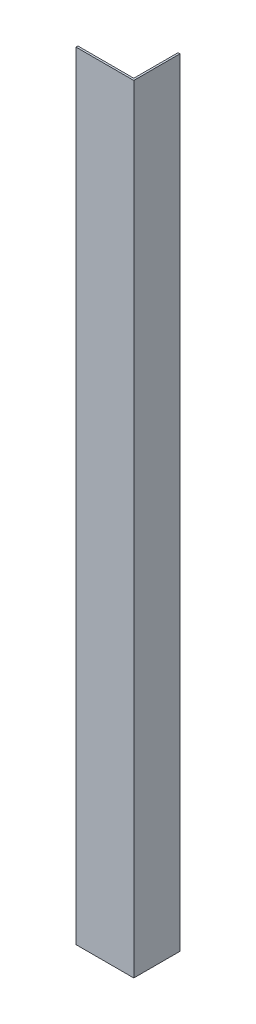
ISO-10303-21;
HEADER;
FILE_DESCRIPTION(('STEP AP214'),'2;1');
FILE_NAME('part.step','',(''),(''),'','','');
FILE_SCHEMA(('AUTOMOTIVE_DESIGN { 1 0 10303 214 1 1 1 1 }'));
ENDSEC;
DATA;
#1=APPLICATION_CONTEXT('core data for automotive mechanical design processes');
#2=APPLICATION_PROTOCOL_DEFINITION('international standard','automotive_design',2000,#1);
#3=PRODUCT_CONTEXT('',#1,'mechanical');
#4=PRODUCT('Part','Part','',(#3));
#5=PRODUCT_RELATED_PRODUCT_CATEGORY('part','',(#4));
#6=PRODUCT_DEFINITION_FORMATION('','',#4);
#7=PRODUCT_DEFINITION_CONTEXT('part definition',#1,'design');
#8=PRODUCT_DEFINITION('design','',#6,#7);
#9=PRODUCT_DEFINITION_SHAPE('','',#8);
#10=(LENGTH_UNIT() NAMED_UNIT(*) SI_UNIT(.MILLI.,.METRE.));
#11=(NAMED_UNIT(*) PLANE_ANGLE_UNIT() SI_UNIT($,.RADIAN.));
#12=(NAMED_UNIT(*) SI_UNIT($,.STERADIAN.) SOLID_ANGLE_UNIT());
#13=UNCERTAINTY_MEASURE_WITH_UNIT(LENGTH_MEASURE(1.E-05),#10,'distance_accuracy_value','');
#14=(GEOMETRIC_REPRESENTATION_CONTEXT(3) GLOBAL_UNCERTAINTY_ASSIGNED_CONTEXT((#13)) GLOBAL_UNIT_ASSIGNED_CONTEXT((#10,
#11,#12)) REPRESENTATION_CONTEXT('',''));
#15=CARTESIAN_POINT('',(0.,0.,0.));
#16=DIRECTION('',(0.,0.,1.));
#17=DIRECTION('',(1.,0.,0.));
#18=AXIS2_PLACEMENT_3D('',#15,#16,#17);
#19=CARTESIAN_POINT('',(0.,202.,-0.5));
#20=DIRECTION('',(1.,0.,0.));
#21=DIRECTION('',(0.,0.,-1.));
#22=AXIS2_PLACEMENT_3D('',#19,#20,#21);
#23=PLANE('',#22);
#24=DIRECTION('',(0.,0.,1.));
#25=VECTOR('',#24,1.);
#26=CARTESIAN_POINT('',(0.,0.,-0.5));
#27=LINE('',#26,#25);
#28=CARTESIAN_POINT('',(0.,0.,-0.5));
#29=VERTEX_POINT('',#28);
#30=CARTESIAN_POINT('',(0.,0.,0.));
#31=VERTEX_POINT('',#30);
#32=EDGE_CURVE('E123',#29,#31,#27,.T.);
#33=ORIENTED_EDGE('',*,*,#32,.T.);
#34=DIRECTION('',(0.,-1.,0.));
#35=VECTOR('',#34,1.);
#36=CARTESIAN_POINT('',(0.,202.,0.));
#37=LINE('',#36,#35);
#38=CARTESIAN_POINT('',(0.,202.,0.));
#39=VERTEX_POINT('',#38);
#40=EDGE_CURVE('E11',#39,#31,#37,.T.);
#41=ORIENTED_EDGE('',*,*,#40,.F.);
#42=DIRECTION('',(0.,0.,1.));
#43=VECTOR('',#42,1.);
#44=CARTESIAN_POINT('',(0.,202.,-0.5));
#45=LINE('',#44,#43);
#46=CARTESIAN_POINT('',(0.,202.,-0.5));
#47=VERTEX_POINT('',#46);
#48=EDGE_CURVE('E133',#47,#39,#45,.T.);
#49=ORIENTED_EDGE('',*,*,#48,.F.);
#50=DIRECTION('',(0.,-1.,0.));
#51=VECTOR('',#50,1.);
#52=CARTESIAN_POINT('',(0.,202.,-0.5));
#53=LINE('',#52,#51);
#54=EDGE_CURVE('E119',#47,#29,#53,.T.);
#55=ORIENTED_EDGE('',*,*,#54,.T.);
#56=EDGE_LOOP('',(#33,#41,#49,#55));
#57=FACE_BOUND('',#56,.T.);
#58=ADVANCED_FACE('F39',(#57),#23,.F.);
#59=CARTESIAN_POINT('',(0.,202.,0.));
#60=DIRECTION('',(0.,0.,-1.));
#61=DIRECTION('',(-1.,0.,0.));
#62=AXIS2_PLACEMENT_3D('',#59,#60,#61);
#63=PLANE('',#62);
#64=DIRECTION('',(1.,0.,0.));
#65=VECTOR('',#64,1.);
#66=CARTESIAN_POINT('',(0.,0.,0.));
#67=LINE('',#66,#65);
#68=CARTESIAN_POINT('',(15.,0.,0.));
#69=VERTEX_POINT('',#68);
#70=EDGE_CURVE('E126',#31,#69,#67,.T.);
#71=ORIENTED_EDGE('',*,*,#70,.T.);
#72=DIRECTION('',(0.,-1.,0.));
#73=VECTOR('',#72,1.);
#74=CARTESIAN_POINT('',(15.,202.,0.));
#75=LINE('',#74,#73);
#76=CARTESIAN_POINT('',(15.,202.,0.));
#77=VERTEX_POINT('',#76);
#78=EDGE_CURVE('E47',#77,#69,#75,.T.);
#79=ORIENTED_EDGE('',*,*,#78,.F.);
#80=DIRECTION('',(1.,0.,0.));
#81=VECTOR('',#80,1.);
#82=CARTESIAN_POINT('',(0.,202.,0.));
#83=LINE('',#82,#81);
#84=EDGE_CURVE('E92',#39,#77,#83,.T.);
#85=ORIENTED_EDGE('',*,*,#84,.F.);
#86=ORIENTED_EDGE('',*,*,#40,.T.);
#87=EDGE_LOOP('',(#71,#79,#85,#86));
#88=FACE_BOUND('',#87,.T.);
#89=ADVANCED_FACE('F157',(#88),#63,.F.);
#90=CARTESIAN_POINT('',(15.,202.,0.));
#91=DIRECTION('',(-1.,0.,0.));
#92=DIRECTION('',(0.,0.,1.));
#93=AXIS2_PLACEMENT_3D('',#90,#91,#92);
#94=PLANE('',#93);
#95=DIRECTION('',(0.,0.,-1.));
#96=VECTOR('',#95,1.);
#97=CARTESIAN_POINT('',(15.,0.,0.));
#98=LINE('',#97,#96);
#99=CARTESIAN_POINT('',(15.,0.,-12.));
#100=VERTEX_POINT('',#99);
#101=EDGE_CURVE('E128',#69,#100,#98,.T.);
#102=ORIENTED_EDGE('',*,*,#101,.T.);
#103=DIRECTION('',(0.,-1.,0.));
#104=VECTOR('',#103,1.);
#105=CARTESIAN_POINT('',(15.,202.,-12.));
#106=LINE('',#105,#104);
#107=CARTESIAN_POINT('',(15.,202.,-12.));
#108=VERTEX_POINT('',#107);
#109=EDGE_CURVE('E114',#108,#100,#106,.T.);
#110=ORIENTED_EDGE('',*,*,#109,.F.);
#111=DIRECTION('',(0.,0.,-1.));
#112=VECTOR('',#111,1.);
#113=CARTESIAN_POINT('',(15.,202.,0.));
#114=LINE('',#113,#112);
#115=EDGE_CURVE('E105',#77,#108,#114,.T.);
#116=ORIENTED_EDGE('',*,*,#115,.F.);
#117=ORIENTED_EDGE('',*,*,#78,.T.);
#118=EDGE_LOOP('',(#102,#110,#116,#117));
#119=FACE_BOUND('',#118,.T.);
#120=ADVANCED_FACE('F139',(#119),#94,.F.);
#121=CARTESIAN_POINT('',(15.,202.,-12.));
#122=DIRECTION('',(0.,0.,1.));
#123=DIRECTION('',(1.,0.,0.));
#124=AXIS2_PLACEMENT_3D('',#121,#122,#123);
#125=PLANE('',#124);
#126=DIRECTION('',(-1.,0.,0.));
#127=VECTOR('',#126,1.);
#128=CARTESIAN_POINT('',(15.,0.,-12.));
#129=LINE('',#128,#127);
#130=CARTESIAN_POINT('',(14.5,0.,-12.));
#131=VERTEX_POINT('',#130);
#132=EDGE_CURVE('E113',#100,#131,#129,.T.);
#133=ORIENTED_EDGE('',*,*,#132,.T.);
#134=DIRECTION('',(0.,-1.,0.));
#135=VECTOR('',#134,1.);
#136=CARTESIAN_POINT('',(14.5,202.,-12.));
#137=LINE('',#136,#135);
#138=CARTESIAN_POINT('',(14.5,202.,-12.));
#139=VERTEX_POINT('',#138);
#140=EDGE_CURVE('E110',#139,#131,#137,.T.);
#141=ORIENTED_EDGE('',*,*,#140,.F.);
#142=DIRECTION('',(-1.,0.,0.));
#143=VECTOR('',#142,1.);
#144=CARTESIAN_POINT('',(15.,202.,-12.));
#145=LINE('',#144,#143);
#146=EDGE_CURVE('E99',#108,#139,#145,.T.);
#147=ORIENTED_EDGE('',*,*,#146,.F.);
#148=ORIENTED_EDGE('',*,*,#109,.T.);
#149=EDGE_LOOP('',(#133,#141,#147,#148));
#150=FACE_BOUND('',#149,.T.);
#151=ADVANCED_FACE('F111',(#150),#125,.F.);
#152=CARTESIAN_POINT('',(14.5,202.,-12.));
#153=DIRECTION('',(1.,0.,0.));
#154=DIRECTION('',(0.,0.,-1.));
#155=AXIS2_PLACEMENT_3D('',#152,#153,#154);
#156=PLANE('',#155);
#157=DIRECTION('',(0.,0.,1.));
#158=VECTOR('',#157,1.);
#159=CARTESIAN_POINT('',(14.5,0.,-12.));
#160=LINE('',#159,#158);
#161=CARTESIAN_POINT('',(14.5,0.,-0.500000000000002));
#162=VERTEX_POINT('',#161);
#163=EDGE_CURVE('E78',#131,#162,#160,.T.);
#164=ORIENTED_EDGE('',*,*,#163,.T.);
#165=DIRECTION('',(0.,-1.,0.));
#166=VECTOR('',#165,1.);
#167=CARTESIAN_POINT('',(14.5,202.,-0.500000000000002));
#168=LINE('',#167,#166);
#169=CARTESIAN_POINT('',(14.5,202.,-0.500000000000002));
#170=VERTEX_POINT('',#169);
#171=EDGE_CURVE('E115',#170,#162,#168,.T.);
#172=ORIENTED_EDGE('',*,*,#171,.F.);
#173=DIRECTION('',(0.,0.,1.));
#174=VECTOR('',#173,1.);
#175=CARTESIAN_POINT('',(14.5,202.,-12.));
#176=LINE('',#175,#174);
#177=EDGE_CURVE('E103',#139,#170,#176,.T.);
#178=ORIENTED_EDGE('',*,*,#177,.F.);
#179=ORIENTED_EDGE('',*,*,#140,.T.);
#180=EDGE_LOOP('',(#164,#172,#178,#179));
#181=FACE_BOUND('',#180,.T.);
#182=ADVANCED_FACE('F117',(#181),#156,.F.);
#183=CARTESIAN_POINT('',(14.5,202.,-0.500000000000002));
#184=DIRECTION('',(0.,0.,1.));
#185=DIRECTION('',(1.,0.,0.));
#186=AXIS2_PLACEMENT_3D('',#183,#184,#185);
#187=PLANE('',#186);
#188=DIRECTION('',(-1.,0.,0.));
#189=VECTOR('',#188,1.);
#190=CARTESIAN_POINT('',(14.5,0.,-0.500000000000002));
#191=LINE('',#190,#189);
#192=EDGE_CURVE('E84',#162,#29,#191,.T.);
#193=ORIENTED_EDGE('',*,*,#192,.T.);
#194=ORIENTED_EDGE('',*,*,#54,.F.);
#195=DIRECTION('',(-1.,0.,0.));
#196=VECTOR('',#195,1.);
#197=CARTESIAN_POINT('',(14.5,202.,-0.500000000000002));
#198=LINE('',#197,#196);
#199=EDGE_CURVE('E55',#170,#47,#198,.T.);
#200=ORIENTED_EDGE('',*,*,#199,.F.);
#201=ORIENTED_EDGE('',*,*,#171,.T.);
#202=EDGE_LOOP('',(#193,#194,#200,#201));
#203=FACE_BOUND('',#202,.T.);
#204=ADVANCED_FACE('F146',(#203),#187,.F.);
#205=CARTESIAN_POINT('',(0.,202.,0.));
#206=DIRECTION('',(0.,1.,0.));
#207=DIRECTION('',(0.,0.,1.));
#208=AXIS2_PLACEMENT_3D('',#205,#206,#207);
#209=PLANE('',#208);
#210=ORIENTED_EDGE('',*,*,#48,.T.);
#211=ORIENTED_EDGE('',*,*,#84,.T.);
#212=ORIENTED_EDGE('',*,*,#115,.T.);
#213=ORIENTED_EDGE('',*,*,#146,.T.);
#214=ORIENTED_EDGE('',*,*,#177,.T.);
#215=ORIENTED_EDGE('',*,*,#199,.T.);
#216=EDGE_LOOP('',(#210,#211,#212,#213,#214,#215));
#217=FACE_BOUND('',#216,.T.);
#218=ADVANCED_FACE('F101',(#217),#209,.T.);
#219=CARTESIAN_POINT('',(0.,0.,0.));
#220=DIRECTION('',(0.,1.,0.));
#221=DIRECTION('',(0.,0.,1.));
#222=AXIS2_PLACEMENT_3D('',#219,#220,#221);
#223=PLANE('',#222);
#224=ORIENTED_EDGE('',*,*,#32,.F.);
#225=ORIENTED_EDGE('',*,*,#192,.F.);
#226=ORIENTED_EDGE('',*,*,#163,.F.);
#227=ORIENTED_EDGE('',*,*,#132,.F.);
#228=ORIENTED_EDGE('',*,*,#101,.F.);
#229=ORIENTED_EDGE('',*,*,#70,.F.);
#230=EDGE_LOOP('',(#224,#225,#226,#227,#228,#229));
#231=FACE_BOUND('',#230,.T.);
#232=ADVANCED_FACE('F142',(#231),#223,.F.);
#233=CLOSED_SHELL('',(#58,#89,#120,#151,#182,#204,#218,#232));
#234=MANIFOLD_SOLID_BREP('B2',#233);
#235=ADVANCED_BREP_SHAPE_REPRESENTATION('',(#18,#234),#14);
#236=SHAPE_DEFINITION_REPRESENTATION(#9,#235);
ENDSEC;
END-ISO-10303-21;
